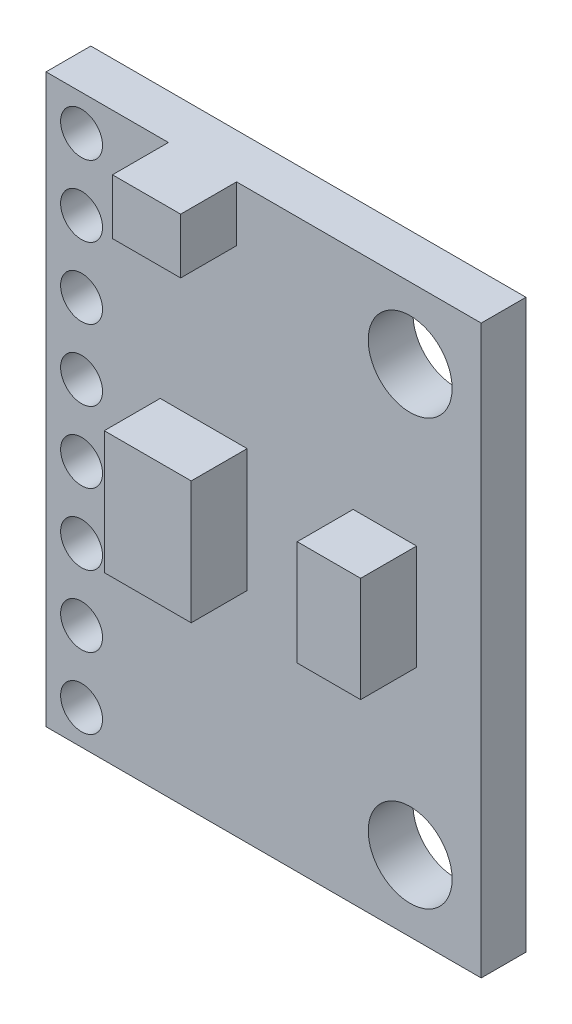
ISO-10303-21;
HEADER;
FILE_DESCRIPTION(('STEP AP214'),'2;1');
FILE_NAME('part.step','',(''),(''),'','','');
FILE_SCHEMA(('AUTOMOTIVE_DESIGN { 1 0 10303 214 1 1 1 1 }'));
ENDSEC;
DATA;
#1=APPLICATION_CONTEXT('core data for automotive mechanical design processes');
#2=APPLICATION_PROTOCOL_DEFINITION('international standard','automotive_design',2000,#1);
#3=PRODUCT_CONTEXT('',#1,'mechanical');
#4=PRODUCT('Part','Part','',(#3));
#5=PRODUCT_RELATED_PRODUCT_CATEGORY('part','',(#4));
#6=PRODUCT_DEFINITION_FORMATION('','',#4);
#7=PRODUCT_DEFINITION_CONTEXT('part definition',#1,'design');
#8=PRODUCT_DEFINITION('design','',#6,#7);
#9=PRODUCT_DEFINITION_SHAPE('','',#8);
#10=(LENGTH_UNIT() NAMED_UNIT(*) SI_UNIT(.MILLI.,.METRE.));
#11=(NAMED_UNIT(*) PLANE_ANGLE_UNIT() SI_UNIT($,.RADIAN.));
#12=(NAMED_UNIT(*) SI_UNIT($,.STERADIAN.) SOLID_ANGLE_UNIT());
#13=UNCERTAINTY_MEASURE_WITH_UNIT(LENGTH_MEASURE(1.E-05),#10,'distance_accuracy_value','');
#14=(GEOMETRIC_REPRESENTATION_CONTEXT(3) GLOBAL_UNCERTAINTY_ASSIGNED_CONTEXT((#13)) GLOBAL_UNIT_ASSIGNED_CONTEXT((#10,
#11,#12)) REPRESENTATION_CONTEXT('',''));
#15=CARTESIAN_POINT('',(0.,0.,0.));
#16=DIRECTION('',(0.,0.,1.));
#17=DIRECTION('',(1.,0.,0.));
#18=AXIS2_PLACEMENT_3D('',#15,#16,#17);
#19=CARTESIAN_POINT('',(0.,0.,1.6));
#20=DIRECTION('',(0.,0.,-1.));
#21=DIRECTION('',(-1.,0.,0.));
#22=AXIS2_PLACEMENT_3D('',#19,#20,#21);
#23=PLANE('',#22);
#24=DIRECTION('',(0.,-1.,0.));
#25=VECTOR('',#24,1.);
#26=CARTESIAN_POINT('',(-3.69806444525977,-2.32607477441693,1.6));
#27=LINE('',#26,#25);
#28=CARTESIAN_POINT('',(-3.69806444525977,2.0683826130572,1.6));
#29=VERTEX_POINT('',#28);
#30=CARTESIAN_POINT('',(-3.69806444525977,-2.32607477441693,1.6));
#31=VERTEX_POINT('',#30);
#32=EDGE_CURVE('E175',#29,#31,#27,.T.);
#33=ORIENTED_EDGE('',*,*,#32,.F.);
#34=DIRECTION('',(-1.,0.,0.));
#35=VECTOR('',#34,1.);
#36=CARTESIAN_POINT('',(-3.69806444525977,2.0683826130572,1.6));
#37=LINE('',#36,#35);
#38=CARTESIAN_POINT('',(-0.588962771203683,2.0683826130572,1.6));
#39=VERTEX_POINT('',#38);
#40=EDGE_CURVE('E190',#39,#29,#37,.T.);
#41=ORIENTED_EDGE('',*,*,#40,.F.);
#42=DIRECTION('',(0.,1.,0.));
#43=VECTOR('',#42,1.);
#44=CARTESIAN_POINT('',(-0.588962771203683,-2.32607477441693,1.6));
#45=LINE('',#44,#43);
#46=CARTESIAN_POINT('',(-0.588962771203683,-2.32607477441693,1.6));
#47=VERTEX_POINT('',#46);
#48=EDGE_CURVE('E201',#47,#39,#45,.T.);
#49=ORIENTED_EDGE('',*,*,#48,.F.);
#50=DIRECTION('',(1.,0.,0.));
#51=VECTOR('',#50,1.);
#52=CARTESIAN_POINT('',(-3.69806444525977,-2.32607477441693,1.6));
#53=LINE('',#52,#51);
#54=EDGE_CURVE('E180',#31,#47,#53,.T.);
#55=ORIENTED_EDGE('',*,*,#54,.F.);
#56=EDGE_LOOP('',(#33,#41,#49,#55));
#57=FACE_BOUND('',#56,.T.);
#58=CARTESIAN_POINT('',(-6.50999999999982,-8.91,1.6));
#59=DIRECTION('',(0.,0.,1.));
#60=DIRECTION('',(1.,0.,0.));
#61=AXIS2_PLACEMENT_3D('',#58,#59,#60);
#62=CIRCLE('',#61,0.750000000000001);
#63=CARTESIAN_POINT('',(-5.75999999999981,-8.91,1.6));
#64=VERTEX_POINT('',#63);
#65=EDGE_CURVE('E256',#64,#64,#62,.T.);
#66=ORIENTED_EDGE('',*,*,#65,.F.);
#67=EDGE_LOOP('',(#66));
#68=FACE_BOUND('',#67,.T.);
#69=CARTESIAN_POINT('',(-6.50999999999984,-6.37,1.6));
#70=DIRECTION('',(0.,0.,1.));
#71=DIRECTION('',(1.,0.,0.));
#72=AXIS2_PLACEMENT_3D('',#69,#70,#71);
#73=CIRCLE('',#72,0.749999999999998);
#74=CARTESIAN_POINT('',(-5.75999999999984,-6.37,1.6));
#75=VERTEX_POINT('',#74);
#76=EDGE_CURVE('E262',#75,#75,#73,.T.);
#77=ORIENTED_EDGE('',*,*,#76,.F.);
#78=EDGE_LOOP('',(#77));
#79=FACE_BOUND('',#78,.T.);
#80=CARTESIAN_POINT('',(-6.50999999999987,-3.83,1.6));
#81=DIRECTION('',(0.,0.,1.));
#82=DIRECTION('',(1.,0.,0.));
#83=AXIS2_PLACEMENT_3D('',#80,#81,#82);
#84=CIRCLE('',#83,0.749999999999999);
#85=CARTESIAN_POINT('',(-5.75999999999987,-3.83,1.6));
#86=VERTEX_POINT('',#85);
#87=EDGE_CURVE('E269',#86,#86,#84,.T.);
#88=ORIENTED_EDGE('',*,*,#87,.F.);
#89=EDGE_LOOP('',(#88));
#90=FACE_BOUND('',#89,.T.);
#91=CARTESIAN_POINT('',(-6.50999999999989,-1.29,1.6));
#92=DIRECTION('',(0.,0.,1.));
#93=DIRECTION('',(1.,0.,0.));
#94=AXIS2_PLACEMENT_3D('',#91,#92,#93);
#95=CIRCLE('',#94,0.749999999999999);
#96=CARTESIAN_POINT('',(-5.75999999999989,-1.29,1.6));
#97=VERTEX_POINT('',#96);
#98=EDGE_CURVE('E275',#97,#97,#95,.T.);
#99=ORIENTED_EDGE('',*,*,#98,.F.);
#100=EDGE_LOOP('',(#99));
#101=FACE_BOUND('',#100,.T.);
#102=CARTESIAN_POINT('',(-6.50999999999992,1.25,1.6));
#103=DIRECTION('',(0.,0.,1.));
#104=DIRECTION('',(1.,0.,0.));
#105=AXIS2_PLACEMENT_3D('',#102,#103,#104);
#106=CIRCLE('',#105,0.749999999999998);
#107=CARTESIAN_POINT('',(-5.75999999999992,1.25,1.6));
#108=VERTEX_POINT('',#107);
#109=EDGE_CURVE('E281',#108,#108,#106,.T.);
#110=ORIENTED_EDGE('',*,*,#109,.F.);
#111=EDGE_LOOP('',(#110));
#112=FACE_BOUND('',#111,.T.);
#113=CARTESIAN_POINT('',(-6.50999999999995,3.79,1.6));
#114=DIRECTION('',(0.,0.,1.));
#115=DIRECTION('',(1.,0.,0.));
#116=AXIS2_PLACEMENT_3D('',#113,#114,#115);
#117=CIRCLE('',#116,0.749999999999999);
#118=CARTESIAN_POINT('',(-5.75999999999995,3.79,1.6));
#119=VERTEX_POINT('',#118);
#120=EDGE_CURVE('E287',#119,#119,#117,.T.);
#121=ORIENTED_EDGE('',*,*,#120,.F.);
#122=EDGE_LOOP('',(#121));
#123=FACE_BOUND('',#122,.T.);
#124=CARTESIAN_POINT('',(-6.50999999999997,6.33,1.6));
#125=DIRECTION('',(0.,0.,1.));
#126=DIRECTION('',(1.,0.,0.));
#127=AXIS2_PLACEMENT_3D('',#124,#125,#126);
#128=CIRCLE('',#127,0.749999999999999);
#129=CARTESIAN_POINT('',(-5.75999999999997,6.33,1.6));
#130=VERTEX_POINT('',#129);
#131=EDGE_CURVE('E294',#130,#130,#128,.T.);
#132=ORIENTED_EDGE('',*,*,#131,.F.);
#133=EDGE_LOOP('',(#132));
#134=FACE_BOUND('',#133,.T.);
#135=CARTESIAN_POINT('',(-6.51,8.87,1.6));
#136=DIRECTION('',(0.,0.,1.));
#137=DIRECTION('',(1.,0.,0.));
#138=AXIS2_PLACEMENT_3D('',#135,#136,#137);
#139=CIRCLE('',#138,0.75);
#140=CARTESIAN_POINT('',(-5.76,8.87,1.6));
#141=VERTEX_POINT('',#140);
#142=EDGE_CURVE('E301',#141,#141,#139,.T.);
#143=ORIENTED_EDGE('',*,*,#142,.F.);
#144=EDGE_LOOP('',(#143));
#145=FACE_BOUND('',#144,.T.);
#146=CARTESIAN_POINT('',(5.24,-7.6,1.6));
#147=DIRECTION('',(0.,0.,1.));
#148=DIRECTION('',(1.,0.,0.));
#149=AXIS2_PLACEMENT_3D('',#146,#147,#148);
#150=CIRCLE('',#149,1.5);
#151=CARTESIAN_POINT('',(6.74,-7.6,1.6));
#152=VERTEX_POINT('',#151);
#153=EDGE_CURVE('E309',#152,#152,#150,.T.);
#154=ORIENTED_EDGE('',*,*,#153,.F.);
#155=EDGE_LOOP('',(#154));
#156=FACE_BOUND('',#155,.T.);
#157=CARTESIAN_POINT('',(5.24,7.6,1.6));
#158=DIRECTION('',(0.,0.,1.));
#159=DIRECTION('',(1.,0.,0.));
#160=AXIS2_PLACEMENT_3D('',#157,#158,#159);
#161=CIRCLE('',#160,1.5);
#162=CARTESIAN_POINT('',(6.74,7.6,1.6));
#163=VERTEX_POINT('',#162);
#164=EDGE_CURVE('E316',#163,#163,#161,.T.);
#165=ORIENTED_EDGE('',*,*,#164,.F.);
#166=EDGE_LOOP('',(#165));
#167=FACE_BOUND('',#166,.T.);
#168=DIRECTION('',(0.,-1.,0.));
#169=VECTOR('',#168,1.);
#170=CARTESIAN_POINT('',(3.20147157033546,-1.67658671529392,1.6));
#171=LINE('',#170,#169);
#172=CARTESIAN_POINT('',(3.20147157033546,2.08129697687109,1.6));
#173=VERTEX_POINT('',#172);
#174=CARTESIAN_POINT('',(3.20147157033546,-1.67658671529392,1.6));
#175=VERTEX_POINT('',#174);
#176=EDGE_CURVE('E218',#173,#175,#171,.T.);
#177=ORIENTED_EDGE('',*,*,#176,.F.);
#178=DIRECTION('',(-1.,0.,0.));
#179=VECTOR('',#178,1.);
#180=CARTESIAN_POINT('',(3.20147157033546,2.08129697687109,1.6));
#181=LINE('',#180,#179);
#182=CARTESIAN_POINT('',(5.46860338229749,2.08129697687109,1.6));
#183=VERTEX_POINT('',#182);
#184=EDGE_CURVE('E224',#183,#173,#181,.T.);
#185=ORIENTED_EDGE('',*,*,#184,.F.);
#186=DIRECTION('',(0.,1.,0.));
#187=VECTOR('',#186,1.);
#188=CARTESIAN_POINT('',(5.46860338229749,-1.67658671529392,1.6));
#189=LINE('',#188,#187);
#190=CARTESIAN_POINT('',(5.46860338229749,-1.67658671529392,1.6));
#191=VERTEX_POINT('',#190);
#192=EDGE_CURVE('E239',#191,#183,#189,.T.);
#193=ORIENTED_EDGE('',*,*,#192,.F.);
#194=DIRECTION('',(1.,0.,0.));
#195=VECTOR('',#194,1.);
#196=CARTESIAN_POINT('',(3.20147157033546,-1.67658671529392,1.6));
#197=LINE('',#196,#195);
#198=EDGE_CURVE('E235',#175,#191,#197,.T.);
#199=ORIENTED_EDGE('',*,*,#198,.F.);
#200=EDGE_LOOP('',(#177,#185,#193,#199));
#201=FACE_BOUND('',#200,.T.);
#202=DIRECTION('',(0.,-1.,0.));
#203=VECTOR('',#202,1.);
#204=CARTESIAN_POINT('',(-3.40442633307703,10.14,1.6));
#205=LINE('',#204,#203);
#206=CARTESIAN_POINT('',(-3.40442633307703,10.14,1.6));
#207=VERTEX_POINT('',#206);
#208=CARTESIAN_POINT('',(-3.40442633307703,8.16390383771193,1.6));
#209=VERTEX_POINT('',#208);
#210=EDGE_CURVE('E173',#207,#209,#205,.T.);
#211=ORIENTED_EDGE('',*,*,#210,.F.);
#212=DIRECTION('',(-1.,0.,0.));
#213=VECTOR('',#212,1.);
#214=CARTESIAN_POINT('',(-7.78,10.14,1.6));
#215=LINE('',#214,#213);
#216=CARTESIAN_POINT('',(-7.78,10.14,1.6));
#217=VERTEX_POINT('',#216);
#218=EDGE_CURVE('E328',#207,#217,#215,.T.);
#219=ORIENTED_EDGE('',*,*,#218,.T.);
#220=DIRECTION('',(0.,-1.,0.));
#221=VECTOR('',#220,1.);
#222=CARTESIAN_POINT('',(-7.78,-10.14,1.6));
#223=LINE('',#222,#221);
#224=CARTESIAN_POINT('',(-7.78,-10.14,1.6));
#225=VERTEX_POINT('',#224);
#226=EDGE_CURVE('E332',#217,#225,#223,.T.);
#227=ORIENTED_EDGE('',*,*,#226,.T.);
#228=DIRECTION('',(1.,0.,0.));
#229=VECTOR('',#228,1.);
#230=CARTESIAN_POINT('',(-7.78,-10.14,1.6));
#231=LINE('',#230,#229);
#232=CARTESIAN_POINT('',(7.78,-10.14,1.6));
#233=VERTEX_POINT('',#232);
#234=EDGE_CURVE('E334',#225,#233,#231,.T.);
#235=ORIENTED_EDGE('',*,*,#234,.T.);
#236=DIRECTION('',(0.,1.,0.));
#237=VECTOR('',#236,1.);
#238=CARTESIAN_POINT('',(7.78,-10.14,1.6));
#239=LINE('',#238,#237);
#240=CARTESIAN_POINT('',(7.78,10.14,1.6));
#241=VERTEX_POINT('',#240);
#242=EDGE_CURVE('E324',#233,#241,#239,.T.);
#243=ORIENTED_EDGE('',*,*,#242,.T.);
#244=CARTESIAN_POINT('',(-0.96660028660267,10.14,1.6));
#245=VERTEX_POINT('',#244);
#246=EDGE_CURVE('E330',#241,#245,#215,.T.);
#247=ORIENTED_EDGE('',*,*,#246,.T.);
#248=DIRECTION('',(0.,1.,0.));
#249=VECTOR('',#248,1.);
#250=CARTESIAN_POINT('',(-0.96660028660267,10.14,1.6));
#251=LINE('',#250,#249);
#252=CARTESIAN_POINT('',(-0.96660028660267,8.16390383771193,1.6));
#253=VERTEX_POINT('',#252);
#254=EDGE_CURVE('E60',#253,#245,#251,.T.);
#255=ORIENTED_EDGE('',*,*,#254,.F.);
#256=DIRECTION('',(1.,0.,0.));
#257=VECTOR('',#256,1.);
#258=CARTESIAN_POINT('',(-3.40442633307703,8.16390383771193,1.6));
#259=LINE('',#258,#257);
#260=EDGE_CURVE('E55',#209,#253,#259,.T.);
#261=ORIENTED_EDGE('',*,*,#260,.F.);
#262=EDGE_LOOP('',(#211,#219,#227,#235,#243,#247,#255,#261));
#263=FACE_BOUND('',#262,.T.);
#264=ADVANCED_FACE('F39',(#57,#68,#79,#90,#101,#112,#123,#134,#145,#156,#167,#201,#263),#23,.F.);
#265=CARTESIAN_POINT('',(0.,0.,0.));
#266=DIRECTION('',(0.,0.,-1.));
#267=DIRECTION('',(-1.,0.,0.));
#268=AXIS2_PLACEMENT_3D('',#265,#266,#267);
#269=PLANE('',#268);
#270=CARTESIAN_POINT('',(-6.50999999999984,-6.37,0.));
#271=DIRECTION('',(0.,0.,1.));
#272=DIRECTION('',(1.,0.,0.));
#273=AXIS2_PLACEMENT_3D('',#270,#271,#272);
#274=CIRCLE('',#273,0.749999999999998);
#275=CARTESIAN_POINT('',(-5.75999999999984,-6.37,0.));
#276=VERTEX_POINT('',#275);
#277=EDGE_CURVE('E259',#276,#276,#274,.T.);
#278=ORIENTED_EDGE('',*,*,#277,.T.);
#279=EDGE_LOOP('',(#278));
#280=FACE_BOUND('',#279,.T.);
#281=CARTESIAN_POINT('',(-6.50999999999989,-1.29,0.));
#282=DIRECTION('',(0.,0.,1.));
#283=DIRECTION('',(1.,0.,0.));
#284=AXIS2_PLACEMENT_3D('',#281,#282,#283);
#285=CIRCLE('',#284,0.749999999999999);
#286=CARTESIAN_POINT('',(-5.75999999999989,-1.29,0.));
#287=VERTEX_POINT('',#286);
#288=EDGE_CURVE('E272',#287,#287,#285,.T.);
#289=ORIENTED_EDGE('',*,*,#288,.T.);
#290=EDGE_LOOP('',(#289));
#291=FACE_BOUND('',#290,.T.);
#292=CARTESIAN_POINT('',(-6.50999999999995,3.79,0.));
#293=DIRECTION('',(0.,0.,1.));
#294=DIRECTION('',(1.,0.,0.));
#295=AXIS2_PLACEMENT_3D('',#292,#293,#294);
#296=CIRCLE('',#295,0.749999999999999);
#297=CARTESIAN_POINT('',(-5.75999999999995,3.79,0.));
#298=VERTEX_POINT('',#297);
#299=EDGE_CURVE('E284',#298,#298,#296,.T.);
#300=ORIENTED_EDGE('',*,*,#299,.T.);
#301=EDGE_LOOP('',(#300));
#302=FACE_BOUND('',#301,.T.);
#303=CARTESIAN_POINT('',(-6.51,8.87,0.));
#304=DIRECTION('',(0.,0.,1.));
#305=DIRECTION('',(1.,0.,0.));
#306=AXIS2_PLACEMENT_3D('',#303,#304,#305);
#307=CIRCLE('',#306,0.75);
#308=CARTESIAN_POINT('',(-5.76,8.87,0.));
#309=VERTEX_POINT('',#308);
#310=EDGE_CURVE('E297',#309,#309,#307,.T.);
#311=ORIENTED_EDGE('',*,*,#310,.T.);
#312=EDGE_LOOP('',(#311));
#313=FACE_BOUND('',#312,.T.);
#314=CARTESIAN_POINT('',(5.24,7.6,0.));
#315=DIRECTION('',(0.,0.,1.));
#316=DIRECTION('',(1.,0.,0.));
#317=AXIS2_PLACEMENT_3D('',#314,#315,#316);
#318=CIRCLE('',#317,1.5);
#319=CARTESIAN_POINT('',(6.74,7.6,0.));
#320=VERTEX_POINT('',#319);
#321=EDGE_CURVE('E313',#320,#320,#318,.T.);
#322=ORIENTED_EDGE('',*,*,#321,.T.);
#323=EDGE_LOOP('',(#322));
#324=FACE_BOUND('',#323,.T.);
#325=DIRECTION('',(0.,1.,0.));
#326=VECTOR('',#325,1.);
#327=CARTESIAN_POINT('',(7.78,-10.14,0.));
#328=LINE('',#327,#326);
#329=CARTESIAN_POINT('',(7.78,-10.14,0.));
#330=VERTEX_POINT('',#329);
#331=CARTESIAN_POINT('',(7.78,10.14,0.));
#332=VERTEX_POINT('',#331);
#333=EDGE_CURVE('E320',#330,#332,#328,.T.);
#334=ORIENTED_EDGE('',*,*,#333,.F.);
#335=DIRECTION('',(1.,0.,0.));
#336=VECTOR('',#335,1.);
#337=CARTESIAN_POINT('',(-7.78,-10.14,0.));
#338=LINE('',#337,#336);
#339=CARTESIAN_POINT('',(-7.78,-10.14,0.));
#340=VERTEX_POINT('',#339);
#341=EDGE_CURVE('E329',#340,#330,#338,.T.);
#342=ORIENTED_EDGE('',*,*,#341,.F.);
#343=DIRECTION('',(0.,-1.,0.));
#344=VECTOR('',#343,1.);
#345=CARTESIAN_POINT('',(-7.78,-10.14,0.));
#346=LINE('',#345,#344);
#347=CARTESIAN_POINT('',(-7.78,10.14,0.));
#348=VERTEX_POINT('',#347);
#349=EDGE_CURVE('E343',#348,#340,#346,.T.);
#350=ORIENTED_EDGE('',*,*,#349,.F.);
#351=DIRECTION('',(-1.,0.,0.));
#352=VECTOR('',#351,1.);
#353=CARTESIAN_POINT('',(-7.78,10.14,0.));
#354=LINE('',#353,#352);
#355=EDGE_CURVE('E340',#332,#348,#354,.T.);
#356=ORIENTED_EDGE('',*,*,#355,.F.);
#357=EDGE_LOOP('',(#334,#342,#350,#356));
#358=FACE_BOUND('',#357,.T.);
#359=CARTESIAN_POINT('',(5.24,-7.6,0.));
#360=DIRECTION('',(0.,0.,1.));
#361=DIRECTION('',(1.,0.,0.));
#362=AXIS2_PLACEMENT_3D('',#359,#360,#361);
#363=CIRCLE('',#362,1.5);
#364=CARTESIAN_POINT('',(6.74,-7.6,0.));
#365=VERTEX_POINT('',#364);
#366=EDGE_CURVE('E305',#365,#365,#363,.T.);
#367=ORIENTED_EDGE('',*,*,#366,.T.);
#368=EDGE_LOOP('',(#367));
#369=FACE_BOUND('',#368,.T.);
#370=CARTESIAN_POINT('',(-6.50999999999997,6.33,0.));
#371=DIRECTION('',(0.,0.,1.));
#372=DIRECTION('',(1.,0.,0.));
#373=AXIS2_PLACEMENT_3D('',#370,#371,#372);
#374=CIRCLE('',#373,0.749999999999999);
#375=CARTESIAN_POINT('',(-5.75999999999997,6.33,0.));
#376=VERTEX_POINT('',#375);
#377=EDGE_CURVE('E291',#376,#376,#374,.T.);
#378=ORIENTED_EDGE('',*,*,#377,.T.);
#379=EDGE_LOOP('',(#378));
#380=FACE_BOUND('',#379,.T.);
#381=CARTESIAN_POINT('',(-6.50999999999992,1.25,0.));
#382=DIRECTION('',(0.,0.,1.));
#383=DIRECTION('',(1.,0.,0.));
#384=AXIS2_PLACEMENT_3D('',#381,#382,#383);
#385=CIRCLE('',#384,0.749999999999998);
#386=CARTESIAN_POINT('',(-5.75999999999992,1.25,0.));
#387=VERTEX_POINT('',#386);
#388=EDGE_CURVE('E278',#387,#387,#385,.T.);
#389=ORIENTED_EDGE('',*,*,#388,.T.);
#390=EDGE_LOOP('',(#389));
#391=FACE_BOUND('',#390,.T.);
#392=CARTESIAN_POINT('',(-6.50999999999987,-3.83,0.));
#393=DIRECTION('',(0.,0.,1.));
#394=DIRECTION('',(1.,0.,0.));
#395=AXIS2_PLACEMENT_3D('',#392,#393,#394);
#396=CIRCLE('',#395,0.749999999999999);
#397=CARTESIAN_POINT('',(-5.75999999999987,-3.83,0.));
#398=VERTEX_POINT('',#397);
#399=EDGE_CURVE('E265',#398,#398,#396,.T.);
#400=ORIENTED_EDGE('',*,*,#399,.T.);
#401=EDGE_LOOP('',(#400));
#402=FACE_BOUND('',#401,.T.);
#403=CARTESIAN_POINT('',(-6.50999999999982,-8.91,0.));
#404=DIRECTION('',(0.,0.,1.));
#405=DIRECTION('',(1.,0.,0.));
#406=AXIS2_PLACEMENT_3D('',#403,#404,#405);
#407=CIRCLE('',#406,0.750000000000001);
#408=CARTESIAN_POINT('',(-5.75999999999981,-8.91,0.));
#409=VERTEX_POINT('',#408);
#410=EDGE_CURVE('E255',#409,#409,#407,.T.);
#411=ORIENTED_EDGE('',*,*,#410,.T.);
#412=EDGE_LOOP('',(#411));
#413=FACE_BOUND('',#412,.T.);
#414=ADVANCED_FACE('F362',(#280,#291,#302,#313,#324,#358,#369,#380,#391,#402,#413),#269,.T.);
#415=CARTESIAN_POINT('',(7.78,-10.14,1.6));
#416=DIRECTION('',(-1.,0.,0.));
#417=DIRECTION('',(0.,0.,1.));
#418=AXIS2_PLACEMENT_3D('',#415,#416,#417);
#419=PLANE('',#418);
#420=ORIENTED_EDGE('',*,*,#333,.T.);
#421=DIRECTION('',(0.,0.,-1.));
#422=VECTOR('',#421,1.);
#423=CARTESIAN_POINT('',(7.78,10.14,1.6));
#424=LINE('',#423,#422);
#425=EDGE_CURVE('E11',#241,#332,#424,.T.);
#426=ORIENTED_EDGE('',*,*,#425,.F.);
#427=ORIENTED_EDGE('',*,*,#242,.F.);
#428=DIRECTION('',(0.,0.,-1.));
#429=VECTOR('',#428,1.);
#430=CARTESIAN_POINT('',(7.78,-10.14,1.6));
#431=LINE('',#430,#429);
#432=EDGE_CURVE('E336',#233,#330,#431,.T.);
#433=ORIENTED_EDGE('',*,*,#432,.T.);
#434=EDGE_LOOP('',(#420,#426,#427,#433));
#435=FACE_BOUND('',#434,.T.);
#436=ADVANCED_FACE('F41',(#435),#419,.F.);
#437=CARTESIAN_POINT('',(-7.78,10.14,1.6));
#438=DIRECTION('',(0.,-1.,0.));
#439=DIRECTION('',(0.,0.,-1.));
#440=AXIS2_PLACEMENT_3D('',#437,#438,#439);
#441=PLANE('',#440);
#442=ORIENTED_EDGE('',*,*,#355,.T.);
#443=DIRECTION('',(0.,0.,-1.));
#444=VECTOR('',#443,1.);
#445=CARTESIAN_POINT('',(-7.78,10.14,1.6));
#446=LINE('',#445,#444);
#447=EDGE_CURVE('E48',#217,#348,#446,.T.);
#448=ORIENTED_EDGE('',*,*,#447,.F.);
#449=ORIENTED_EDGE('',*,*,#218,.F.);
#450=DIRECTION('',(0.,0.,-1.));
#451=VECTOR('',#450,1.);
#452=CARTESIAN_POINT('',(-3.40442633307703,10.14,3.6));
#453=LINE('',#452,#451);
#454=CARTESIAN_POINT('',(-3.40442633307703,10.14,3.6));
#455=VERTEX_POINT('',#454);
#456=EDGE_CURVE('E372',#455,#207,#453,.T.);
#457=ORIENTED_EDGE('',*,*,#456,.F.);
#458=DIRECTION('',(-1.,0.,0.));
#459=VECTOR('',#458,1.);
#460=CARTESIAN_POINT('',(-3.40442633307703,10.14,3.6));
#461=LINE('',#460,#459);
#462=CARTESIAN_POINT('',(-0.96660028660267,10.14,3.6));
#463=VERTEX_POINT('',#462);
#464=EDGE_CURVE('E167',#463,#455,#461,.T.);
#465=ORIENTED_EDGE('',*,*,#464,.F.);
#466=DIRECTION('',(0.,0.,-1.));
#467=VECTOR('',#466,1.);
#468=CARTESIAN_POINT('',(-0.96660028660267,10.14,3.6));
#469=LINE('',#468,#467);
#470=EDGE_CURVE('E182',#463,#245,#469,.T.);
#471=ORIENTED_EDGE('',*,*,#470,.T.);
#472=ORIENTED_EDGE('',*,*,#246,.F.);
#473=ORIENTED_EDGE('',*,*,#425,.T.);
#474=EDGE_LOOP('',(#442,#448,#449,#457,#465,#471,#472,#473));
#475=FACE_BOUND('',#474,.T.);
#476=ADVANCED_FACE('F371',(#475),#441,.F.);
#477=CARTESIAN_POINT('',(-7.78,-10.14,1.6));
#478=DIRECTION('',(1.,0.,0.));
#479=DIRECTION('',(0.,0.,-1.));
#480=AXIS2_PLACEMENT_3D('',#477,#478,#479);
#481=PLANE('',#480);
#482=ORIENTED_EDGE('',*,*,#349,.T.);
#483=DIRECTION('',(0.,0.,-1.));
#484=VECTOR('',#483,1.);
#485=CARTESIAN_POINT('',(-7.78,-10.14,1.6));
#486=LINE('',#485,#484);
#487=EDGE_CURVE('E349',#225,#340,#486,.T.);
#488=ORIENTED_EDGE('',*,*,#487,.F.);
#489=ORIENTED_EDGE('',*,*,#226,.F.);
#490=ORIENTED_EDGE('',*,*,#447,.T.);
#491=EDGE_LOOP('',(#482,#488,#489,#490));
#492=FACE_BOUND('',#491,.T.);
#493=ADVANCED_FACE('F356',(#492),#481,.F.);
#494=CARTESIAN_POINT('',(-7.78,-10.14,1.6));
#495=DIRECTION('',(0.,1.,0.));
#496=DIRECTION('',(0.,0.,1.));
#497=AXIS2_PLACEMENT_3D('',#494,#495,#496);
#498=PLANE('',#497);
#499=ORIENTED_EDGE('',*,*,#341,.T.);
#500=ORIENTED_EDGE('',*,*,#432,.F.);
#501=ORIENTED_EDGE('',*,*,#234,.F.);
#502=ORIENTED_EDGE('',*,*,#487,.T.);
#503=EDGE_LOOP('',(#499,#500,#501,#502));
#504=FACE_BOUND('',#503,.T.);
#505=ADVANCED_FACE('F366',(#504),#498,.F.);
#506=CARTESIAN_POINT('',(5.24,7.6,1.6));
#507=DIRECTION('',(0.,0.,-1.));
#508=DIRECTION('',(-1.,0.,0.));
#509=AXIS2_PLACEMENT_3D('',#506,#507,#508);
#510=CYLINDRICAL_SURFACE('',#509,1.5);
#511=ORIENTED_EDGE('',*,*,#164,.T.);
#512=EDGE_LOOP('',(#511));
#513=FACE_BOUND('',#512,.T.);
#514=ORIENTED_EDGE('',*,*,#321,.F.);
#515=EDGE_LOOP('',(#514));
#516=FACE_BOUND('',#515,.T.);
#517=ADVANCED_FACE('F401',(#513,#516),#510,.F.);
#518=CARTESIAN_POINT('',(5.24,-7.6,1.6));
#519=DIRECTION('',(0.,0.,-1.));
#520=DIRECTION('',(-1.,0.,0.));
#521=AXIS2_PLACEMENT_3D('',#518,#519,#520);
#522=CYLINDRICAL_SURFACE('',#521,1.5);
#523=ORIENTED_EDGE('',*,*,#153,.T.);
#524=EDGE_LOOP('',(#523));
#525=FACE_BOUND('',#524,.T.);
#526=ORIENTED_EDGE('',*,*,#366,.F.);
#527=EDGE_LOOP('',(#526));
#528=FACE_BOUND('',#527,.T.);
#529=ADVANCED_FACE('F430',(#525,#528),#522,.F.);
#530=CARTESIAN_POINT('',(-6.51,8.87,1.6));
#531=DIRECTION('',(0.,0.,-1.));
#532=DIRECTION('',(-1.,0.,0.));
#533=AXIS2_PLACEMENT_3D('',#530,#531,#532);
#534=CYLINDRICAL_SURFACE('',#533,0.75);
#535=ORIENTED_EDGE('',*,*,#142,.T.);
#536=EDGE_LOOP('',(#535));
#537=FACE_BOUND('',#536,.T.);
#538=ORIENTED_EDGE('',*,*,#310,.F.);
#539=EDGE_LOOP('',(#538));
#540=FACE_BOUND('',#539,.T.);
#541=ADVANCED_FACE('F425',(#537,#540),#534,.F.);
#542=CARTESIAN_POINT('',(-6.50999999999997,6.33,1.6));
#543=DIRECTION('',(0.,0.,-1.));
#544=DIRECTION('',(-1.,0.,0.));
#545=AXIS2_PLACEMENT_3D('',#542,#543,#544);
#546=CYLINDRICAL_SURFACE('',#545,0.749999999999999);
#547=ORIENTED_EDGE('',*,*,#131,.T.);
#548=EDGE_LOOP('',(#547));
#549=FACE_BOUND('',#548,.T.);
#550=ORIENTED_EDGE('',*,*,#377,.F.);
#551=EDGE_LOOP('',(#550));
#552=FACE_BOUND('',#551,.T.);
#553=ADVANCED_FACE('F429',(#549,#552),#546,.F.);
#554=CARTESIAN_POINT('',(-6.50999999999995,3.79,1.6));
#555=DIRECTION('',(0.,0.,-1.));
#556=DIRECTION('',(-1.,0.,0.));
#557=AXIS2_PLACEMENT_3D('',#554,#555,#556);
#558=CYLINDRICAL_SURFACE('',#557,0.749999999999999);
#559=ORIENTED_EDGE('',*,*,#120,.T.);
#560=EDGE_LOOP('',(#559));
#561=FACE_BOUND('',#560,.T.);
#562=ORIENTED_EDGE('',*,*,#299,.F.);
#563=EDGE_LOOP('',(#562));
#564=FACE_BOUND('',#563,.T.);
#565=ADVANCED_FACE('F443',(#561,#564),#558,.F.);
#566=CARTESIAN_POINT('',(-6.50999999999992,1.25,1.6));
#567=DIRECTION('',(0.,0.,-1.));
#568=DIRECTION('',(-1.,0.,0.));
#569=AXIS2_PLACEMENT_3D('',#566,#567,#568);
#570=CYLINDRICAL_SURFACE('',#569,0.749999999999998);
#571=ORIENTED_EDGE('',*,*,#109,.T.);
#572=EDGE_LOOP('',(#571));
#573=FACE_BOUND('',#572,.T.);
#574=ORIENTED_EDGE('',*,*,#388,.F.);
#575=EDGE_LOOP('',(#574));
#576=FACE_BOUND('',#575,.T.);
#577=ADVANCED_FACE('F470',(#573,#576),#570,.F.);
#578=CARTESIAN_POINT('',(-6.50999999999989,-1.29,1.6));
#579=DIRECTION('',(0.,0.,-1.));
#580=DIRECTION('',(-1.,0.,0.));
#581=AXIS2_PLACEMENT_3D('',#578,#579,#580);
#582=CYLINDRICAL_SURFACE('',#581,0.749999999999999);
#583=ORIENTED_EDGE('',*,*,#98,.T.);
#584=EDGE_LOOP('',(#583));
#585=FACE_BOUND('',#584,.T.);
#586=ORIENTED_EDGE('',*,*,#288,.F.);
#587=EDGE_LOOP('',(#586));
#588=FACE_BOUND('',#587,.T.);
#589=ADVANCED_FACE('F478',(#585,#588),#582,.F.);
#590=CARTESIAN_POINT('',(-6.50999999999987,-3.83,1.6));
#591=DIRECTION('',(0.,0.,-1.));
#592=DIRECTION('',(-1.,0.,0.));
#593=AXIS2_PLACEMENT_3D('',#590,#591,#592);
#594=CYLINDRICAL_SURFACE('',#593,0.749999999999999);
#595=ORIENTED_EDGE('',*,*,#87,.T.);
#596=EDGE_LOOP('',(#595));
#597=FACE_BOUND('',#596,.T.);
#598=ORIENTED_EDGE('',*,*,#399,.F.);
#599=EDGE_LOOP('',(#598));
#600=FACE_BOUND('',#599,.T.);
#601=ADVANCED_FACE('F486',(#597,#600),#594,.F.);
#602=CARTESIAN_POINT('',(-6.50999999999984,-6.37,1.6));
#603=DIRECTION('',(0.,0.,-1.));
#604=DIRECTION('',(-1.,0.,0.));
#605=AXIS2_PLACEMENT_3D('',#602,#603,#604);
#606=CYLINDRICAL_SURFACE('',#605,0.749999999999998);
#607=ORIENTED_EDGE('',*,*,#76,.T.);
#608=EDGE_LOOP('',(#607));
#609=FACE_BOUND('',#608,.T.);
#610=ORIENTED_EDGE('',*,*,#277,.F.);
#611=EDGE_LOOP('',(#610));
#612=FACE_BOUND('',#611,.T.);
#613=ADVANCED_FACE('F494',(#609,#612),#606,.F.);
#614=CARTESIAN_POINT('',(-6.50999999999982,-8.91,1.6));
#615=DIRECTION('',(0.,0.,-1.));
#616=DIRECTION('',(-1.,0.,0.));
#617=AXIS2_PLACEMENT_3D('',#614,#615,#616);
#618=CYLINDRICAL_SURFACE('',#617,0.750000000000001);
#619=ORIENTED_EDGE('',*,*,#65,.T.);
#620=EDGE_LOOP('',(#619));
#621=FACE_BOUND('',#620,.T.);
#622=ORIENTED_EDGE('',*,*,#410,.F.);
#623=EDGE_LOOP('',(#622));
#624=FACE_BOUND('',#623,.T.);
#625=ADVANCED_FACE('F502',(#621,#624),#618,.F.);
#626=CARTESIAN_POINT('',(3.20147157033546,-1.67658671529392,3.6));
#627=DIRECTION('',(1.,0.,0.));
#628=DIRECTION('',(0.,0.,-1.));
#629=AXIS2_PLACEMENT_3D('',#626,#627,#628);
#630=PLANE('',#629);
#631=ORIENTED_EDGE('',*,*,#176,.T.);
#632=DIRECTION('',(0.,0.,-1.));
#633=VECTOR('',#632,1.);
#634=CARTESIAN_POINT('',(3.20147157033546,-1.67658671529392,3.6));
#635=LINE('',#634,#633);
#636=CARTESIAN_POINT('',(3.20147157033546,-1.67658671529392,3.6));
#637=VERTEX_POINT('',#636);
#638=EDGE_CURVE('E252',#637,#175,#635,.T.);
#639=ORIENTED_EDGE('',*,*,#638,.F.);
#640=DIRECTION('',(0.,-1.,0.));
#641=VECTOR('',#640,1.);
#642=CARTESIAN_POINT('',(3.20147157033546,-1.67658671529392,3.6));
#643=LINE('',#642,#641);
#644=CARTESIAN_POINT('',(3.20147157033546,2.08129697687109,3.6));
#645=VERTEX_POINT('',#644);
#646=EDGE_CURVE('E219',#645,#637,#643,.T.);
#647=ORIENTED_EDGE('',*,*,#646,.F.);
#648=DIRECTION('',(0.,0.,-1.));
#649=VECTOR('',#648,1.);
#650=CARTESIAN_POINT('',(3.20147157033546,2.08129697687109,3.6));
#651=LINE('',#650,#649);
#652=EDGE_CURVE('E232',#645,#173,#651,.T.);
#653=ORIENTED_EDGE('',*,*,#652,.T.);
#654=EDGE_LOOP('',(#631,#639,#647,#653));
#655=FACE_BOUND('',#654,.T.);
#656=ADVANCED_FACE('F510',(#655),#630,.F.);
#657=CARTESIAN_POINT('',(3.20147157033546,-1.67658671529392,3.6));
#658=DIRECTION('',(0.,1.,0.));
#659=DIRECTION('',(0.,0.,1.));
#660=AXIS2_PLACEMENT_3D('',#657,#658,#659);
#661=PLANE('',#660);
#662=ORIENTED_EDGE('',*,*,#198,.T.);
#663=DIRECTION('',(0.,0.,-1.));
#664=VECTOR('',#663,1.);
#665=CARTESIAN_POINT('',(5.46860338229749,-1.67658671529392,3.6));
#666=LINE('',#665,#664);
#667=CARTESIAN_POINT('',(5.46860338229749,-1.67658671529392,3.6));
#668=VERTEX_POINT('',#667);
#669=EDGE_CURVE('E249',#668,#191,#666,.T.);
#670=ORIENTED_EDGE('',*,*,#669,.F.);
#671=DIRECTION('',(1.,0.,0.));
#672=VECTOR('',#671,1.);
#673=CARTESIAN_POINT('',(3.20147157033546,-1.67658671529392,3.6));
#674=LINE('',#673,#672);
#675=EDGE_CURVE('E223',#637,#668,#674,.T.);
#676=ORIENTED_EDGE('',*,*,#675,.F.);
#677=ORIENTED_EDGE('',*,*,#638,.T.);
#678=EDGE_LOOP('',(#662,#670,#676,#677));
#679=FACE_BOUND('',#678,.T.);
#680=ADVANCED_FACE('F519',(#679),#661,.F.);
#681=CARTESIAN_POINT('',(5.46860338229749,-1.67658671529392,3.6));
#682=DIRECTION('',(-1.,0.,0.));
#683=DIRECTION('',(0.,0.,1.));
#684=AXIS2_PLACEMENT_3D('',#681,#682,#683);
#685=PLANE('',#684);
#686=ORIENTED_EDGE('',*,*,#192,.T.);
#687=DIRECTION('',(0.,0.,-1.));
#688=VECTOR('',#687,1.);
#689=CARTESIAN_POINT('',(5.46860338229749,2.08129697687109,3.6));
#690=LINE('',#689,#688);
#691=CARTESIAN_POINT('',(5.46860338229749,2.08129697687109,3.6));
#692=VERTEX_POINT('',#691);
#693=EDGE_CURVE('E246',#692,#183,#690,.T.);
#694=ORIENTED_EDGE('',*,*,#693,.F.);
#695=DIRECTION('',(0.,1.,0.));
#696=VECTOR('',#695,1.);
#697=CARTESIAN_POINT('',(5.46860338229749,-1.67658671529392,3.6));
#698=LINE('',#697,#696);
#699=EDGE_CURVE('E227',#668,#692,#698,.T.);
#700=ORIENTED_EDGE('',*,*,#699,.F.);
#701=ORIENTED_EDGE('',*,*,#669,.T.);
#702=EDGE_LOOP('',(#686,#694,#700,#701));
#703=FACE_BOUND('',#702,.T.);
#704=ADVANCED_FACE('F527',(#703),#685,.F.);
#705=CARTESIAN_POINT('',(3.20147157033546,2.08129697687109,3.6));
#706=DIRECTION('',(0.,-1.,0.));
#707=DIRECTION('',(0.,0.,-1.));
#708=AXIS2_PLACEMENT_3D('',#705,#706,#707);
#709=PLANE('',#708);
#710=ORIENTED_EDGE('',*,*,#184,.T.);
#711=ORIENTED_EDGE('',*,*,#652,.F.);
#712=DIRECTION('',(-1.,0.,0.));
#713=VECTOR('',#712,1.);
#714=CARTESIAN_POINT('',(3.20147157033546,2.08129697687109,3.6));
#715=LINE('',#714,#713);
#716=EDGE_CURVE('E229',#692,#645,#715,.T.);
#717=ORIENTED_EDGE('',*,*,#716,.F.);
#718=ORIENTED_EDGE('',*,*,#693,.T.);
#719=EDGE_LOOP('',(#710,#711,#717,#718));
#720=FACE_BOUND('',#719,.T.);
#721=ADVANCED_FACE('F535',(#720),#709,.F.);
#722=CARTESIAN_POINT('',(0.,0.,3.6));
#723=DIRECTION('',(0.,0.,-1.));
#724=DIRECTION('',(-1.,0.,0.));
#725=AXIS2_PLACEMENT_3D('',#722,#723,#724);
#726=PLANE('',#725);
#727=ORIENTED_EDGE('',*,*,#646,.T.);
#728=ORIENTED_EDGE('',*,*,#675,.T.);
#729=ORIENTED_EDGE('',*,*,#699,.T.);
#730=ORIENTED_EDGE('',*,*,#716,.T.);
#731=EDGE_LOOP('',(#727,#728,#729,#730));
#732=FACE_BOUND('',#731,.T.);
#733=ADVANCED_FACE('F543',(#732),#726,.F.);
#734=CARTESIAN_POINT('',(-3.69806444525977,-2.32607477441693,3.6));
#735=DIRECTION('',(1.,0.,0.));
#736=DIRECTION('',(0.,0.,-1.));
#737=AXIS2_PLACEMENT_3D('',#734,#735,#736);
#738=PLANE('',#737);
#739=ORIENTED_EDGE('',*,*,#32,.T.);
#740=DIRECTION('',(0.,0.,-1.));
#741=VECTOR('',#740,1.);
#742=CARTESIAN_POINT('',(-3.69806444525977,-2.32607477441693,3.6));
#743=LINE('',#742,#741);
#744=CARTESIAN_POINT('',(-3.69806444525977,-2.32607477441693,3.6));
#745=VERTEX_POINT('',#744);
#746=EDGE_CURVE('E215',#745,#31,#743,.T.);
#747=ORIENTED_EDGE('',*,*,#746,.F.);
#748=DIRECTION('',(0.,-1.,0.));
#749=VECTOR('',#748,1.);
#750=CARTESIAN_POINT('',(-3.69806444525977,-2.32607477441693,3.6));
#751=LINE('',#750,#749);
#752=CARTESIAN_POINT('',(-3.69806444525977,2.0683826130572,3.6));
#753=VERTEX_POINT('',#752);
#754=EDGE_CURVE('E186',#753,#745,#751,.T.);
#755=ORIENTED_EDGE('',*,*,#754,.F.);
#756=DIRECTION('',(0.,0.,-1.));
#757=VECTOR('',#756,1.);
#758=CARTESIAN_POINT('',(-3.69806444525977,2.0683826130572,3.6));
#759=LINE('',#758,#757);
#760=EDGE_CURVE('E196',#753,#29,#759,.T.);
#761=ORIENTED_EDGE('',*,*,#760,.T.);
#762=EDGE_LOOP('',(#739,#747,#755,#761));
#763=FACE_BOUND('',#762,.T.);
#764=ADVANCED_FACE('F551',(#763),#738,.F.);
#765=CARTESIAN_POINT('',(-3.69806444525977,-2.32607477441693,3.6));
#766=DIRECTION('',(0.,1.,0.));
#767=DIRECTION('',(0.,0.,1.));
#768=AXIS2_PLACEMENT_3D('',#765,#766,#767);
#769=PLANE('',#768);
#770=ORIENTED_EDGE('',*,*,#54,.T.);
#771=DIRECTION('',(0.,0.,-1.));
#772=VECTOR('',#771,1.);
#773=CARTESIAN_POINT('',(-0.588962771203683,-2.32607477441693,3.6));
#774=LINE('',#773,#772);
#775=CARTESIAN_POINT('',(-0.588962771203683,-2.32607477441693,3.6));
#776=VERTEX_POINT('',#775);
#777=EDGE_CURVE('E212',#776,#47,#774,.T.);
#778=ORIENTED_EDGE('',*,*,#777,.F.);
#779=DIRECTION('',(1.,0.,0.));
#780=VECTOR('',#779,1.);
#781=CARTESIAN_POINT('',(-3.69806444525977,-2.32607477441693,3.6));
#782=LINE('',#781,#780);
#783=EDGE_CURVE('E189',#745,#776,#782,.T.);
#784=ORIENTED_EDGE('',*,*,#783,.F.);
#785=ORIENTED_EDGE('',*,*,#746,.T.);
#786=EDGE_LOOP('',(#770,#778,#784,#785));
#787=FACE_BOUND('',#786,.T.);
#788=ADVANCED_FACE('F559',(#787),#769,.F.);
#789=CARTESIAN_POINT('',(-0.588962771203683,-2.32607477441693,3.6));
#790=DIRECTION('',(-1.,0.,0.));
#791=DIRECTION('',(0.,0.,1.));
#792=AXIS2_PLACEMENT_3D('',#789,#790,#791);
#793=PLANE('',#792);
#794=ORIENTED_EDGE('',*,*,#48,.T.);
#795=DIRECTION('',(0.,0.,-1.));
#796=VECTOR('',#795,1.);
#797=CARTESIAN_POINT('',(-0.588962771203683,2.0683826130572,3.6));
#798=LINE('',#797,#796);
#799=CARTESIAN_POINT('',(-0.588962771203683,2.0683826130572,3.6));
#800=VERTEX_POINT('',#799);
#801=EDGE_CURVE('E209',#800,#39,#798,.T.);
#802=ORIENTED_EDGE('',*,*,#801,.F.);
#803=DIRECTION('',(0.,1.,0.));
#804=VECTOR('',#803,1.);
#805=CARTESIAN_POINT('',(-0.588962771203683,-2.32607477441693,3.6));
#806=LINE('',#805,#804);
#807=EDGE_CURVE('E192',#776,#800,#806,.T.);
#808=ORIENTED_EDGE('',*,*,#807,.F.);
#809=ORIENTED_EDGE('',*,*,#777,.T.);
#810=EDGE_LOOP('',(#794,#802,#808,#809));
#811=FACE_BOUND('',#810,.T.);
#812=ADVANCED_FACE('F567',(#811),#793,.F.);
#813=CARTESIAN_POINT('',(-3.69806444525977,2.0683826130572,3.6));
#814=DIRECTION('',(0.,-1.,0.));
#815=DIRECTION('',(0.,0.,-1.));
#816=AXIS2_PLACEMENT_3D('',#813,#814,#815);
#817=PLANE('',#816);
#818=ORIENTED_EDGE('',*,*,#40,.T.);
#819=ORIENTED_EDGE('',*,*,#760,.F.);
#820=DIRECTION('',(-1.,0.,0.));
#821=VECTOR('',#820,1.);
#822=CARTESIAN_POINT('',(-3.69806444525977,2.0683826130572,3.6));
#823=LINE('',#822,#821);
#824=EDGE_CURVE('E194',#800,#753,#823,.T.);
#825=ORIENTED_EDGE('',*,*,#824,.F.);
#826=ORIENTED_EDGE('',*,*,#801,.T.);
#827=EDGE_LOOP('',(#818,#819,#825,#826));
#828=FACE_BOUND('',#827,.T.);
#829=ADVANCED_FACE('F575',(#828),#817,.F.);
#830=CARTESIAN_POINT('',(0.,0.,3.6));
#831=DIRECTION('',(0.,0.,-1.));
#832=DIRECTION('',(-1.,0.,0.));
#833=AXIS2_PLACEMENT_3D('',#830,#831,#832);
#834=PLANE('',#833);
#835=ORIENTED_EDGE('',*,*,#754,.T.);
#836=ORIENTED_EDGE('',*,*,#783,.T.);
#837=ORIENTED_EDGE('',*,*,#807,.T.);
#838=ORIENTED_EDGE('',*,*,#824,.T.);
#839=EDGE_LOOP('',(#835,#836,#837,#838));
#840=FACE_BOUND('',#839,.T.);
#841=ADVANCED_FACE('F583',(#840),#834,.F.);
#842=CARTESIAN_POINT('',(-3.40442633307703,10.14,3.6));
#843=DIRECTION('',(1.,0.,0.));
#844=DIRECTION('',(0.,0.,-1.));
#845=AXIS2_PLACEMENT_3D('',#842,#843,#844);
#846=PLANE('',#845);
#847=ORIENTED_EDGE('',*,*,#210,.T.);
#848=DIRECTION('',(0.,0.,-1.));
#849=VECTOR('',#848,1.);
#850=CARTESIAN_POINT('',(-3.40442633307703,8.16390383771193,3.6));
#851=LINE('',#850,#849);
#852=CARTESIAN_POINT('',(-3.40442633307703,8.16390383771193,3.6));
#853=VERTEX_POINT('',#852);
#854=EDGE_CURVE('E155',#853,#209,#851,.T.);
#855=ORIENTED_EDGE('',*,*,#854,.F.);
#856=DIRECTION('',(0.,-1.,0.));
#857=VECTOR('',#856,1.);
#858=CARTESIAN_POINT('',(-3.40442633307703,10.14,3.6));
#859=LINE('',#858,#857);
#860=EDGE_CURVE('E162',#455,#853,#859,.T.);
#861=ORIENTED_EDGE('',*,*,#860,.F.);
#862=ORIENTED_EDGE('',*,*,#456,.T.);
#863=EDGE_LOOP('',(#847,#855,#861,#862));
#864=FACE_BOUND('',#863,.T.);
#865=ADVANCED_FACE('F172',(#864),#846,.F.);
#866=CARTESIAN_POINT('',(-3.40442633307703,8.16390383771193,3.6));
#867=DIRECTION('',(0.,1.,0.));
#868=DIRECTION('',(0.,0.,1.));
#869=AXIS2_PLACEMENT_3D('',#866,#867,#868);
#870=PLANE('',#869);
#871=ORIENTED_EDGE('',*,*,#260,.T.);
#872=DIRECTION('',(0.,0.,-1.));
#873=VECTOR('',#872,1.);
#874=CARTESIAN_POINT('',(-0.96660028660267,8.16390383771193,3.6));
#875=LINE('',#874,#873);
#876=CARTESIAN_POINT('',(-0.96660028660267,8.16390383771193,3.6));
#877=VERTEX_POINT('',#876);
#878=EDGE_CURVE('E158',#877,#253,#875,.T.);
#879=ORIENTED_EDGE('',*,*,#878,.F.);
#880=DIRECTION('',(1.,0.,0.));
#881=VECTOR('',#880,1.);
#882=CARTESIAN_POINT('',(-3.40442633307703,8.16390383771193,3.6));
#883=LINE('',#882,#881);
#884=EDGE_CURVE('E151',#853,#877,#883,.T.);
#885=ORIENTED_EDGE('',*,*,#884,.F.);
#886=ORIENTED_EDGE('',*,*,#854,.T.);
#887=EDGE_LOOP('',(#871,#879,#885,#886));
#888=FACE_BOUND('',#887,.T.);
#889=ADVANCED_FACE('F153',(#888),#870,.F.);
#890=CARTESIAN_POINT('',(-0.96660028660267,10.14,3.6));
#891=DIRECTION('',(-1.,0.,0.));
#892=DIRECTION('',(0.,-1.,0.));
#893=AXIS2_PLACEMENT_3D('',#890,#891,#892);
#894=PLANE('',#893);
#895=ORIENTED_EDGE('',*,*,#254,.T.);
#896=ORIENTED_EDGE('',*,*,#470,.F.);
#897=DIRECTION('',(0.,1.,0.));
#898=VECTOR('',#897,1.);
#899=CARTESIAN_POINT('',(-0.96660028660267,10.14,3.6));
#900=LINE('',#899,#898);
#901=EDGE_CURVE('E161',#877,#463,#900,.T.);
#902=ORIENTED_EDGE('',*,*,#901,.F.);
#903=ORIENTED_EDGE('',*,*,#878,.T.);
#904=EDGE_LOOP('',(#895,#896,#902,#903));
#905=FACE_BOUND('',#904,.T.);
#906=ADVANCED_FACE('F383',(#905),#894,.F.);
#907=CARTESIAN_POINT('',(0.,0.,3.6));
#908=DIRECTION('',(0.,0.,1.));
#909=DIRECTION('',(1.,0.,0.));
#910=AXIS2_PLACEMENT_3D('',#907,#908,#909);
#911=PLANE('',#910);
#912=ORIENTED_EDGE('',*,*,#860,.T.);
#913=ORIENTED_EDGE('',*,*,#884,.T.);
#914=ORIENTED_EDGE('',*,*,#901,.T.);
#915=ORIENTED_EDGE('',*,*,#464,.T.);
#916=EDGE_LOOP('',(#912,#913,#914,#915));
#917=FACE_BOUND('',#916,.T.);
#918=ADVANCED_FACE('F165',(#917),#911,.T.);
#919=CLOSED_SHELL('',(#264,#414,#436,#476,#493,#505,#517,#529,#541,#553,#565,#577,#589,#601,
#613,#625,#656,#680,#704,#721,#733,#764,#788,#812,#829,#841,#865,#889,#906,#918));
#920=MANIFOLD_SOLID_BREP('B2',#919);
#921=ADVANCED_BREP_SHAPE_REPRESENTATION('',(#18,#920),#14);
#922=SHAPE_DEFINITION_REPRESENTATION(#9,#921);
ENDSEC;
END-ISO-10303-21;
